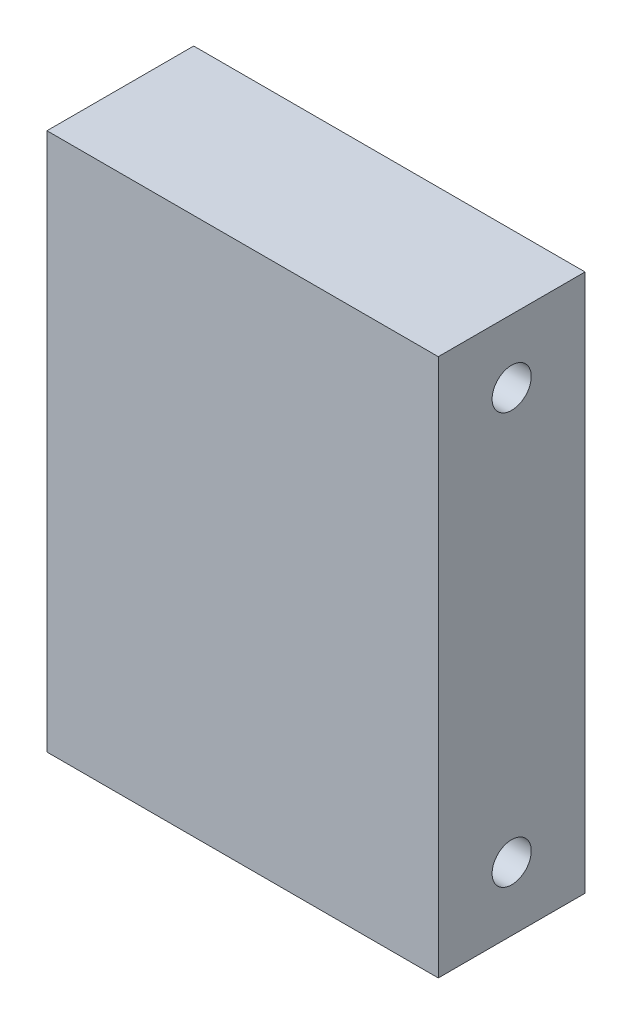
ISO-10303-21;
HEADER;
FILE_DESCRIPTION(('STEP AP214'),'2;1');
FILE_NAME('part.step','',(''),(''),'','','');
FILE_SCHEMA(('AUTOMOTIVE_DESIGN { 1 0 10303 214 1 1 1 1 }'));
ENDSEC;
DATA;
#1=APPLICATION_CONTEXT('core data for automotive mechanical design processes');
#2=APPLICATION_PROTOCOL_DEFINITION('international standard','automotive_design',2000,#1);
#3=PRODUCT_CONTEXT('',#1,'mechanical');
#4=PRODUCT('Part','Part','',(#3));
#5=PRODUCT_RELATED_PRODUCT_CATEGORY('part','',(#4));
#6=PRODUCT_DEFINITION_FORMATION('','',#4);
#7=PRODUCT_DEFINITION_CONTEXT('part definition',#1,'design');
#8=PRODUCT_DEFINITION('design','',#6,#7);
#9=PRODUCT_DEFINITION_SHAPE('','',#8);
#10=(LENGTH_UNIT() NAMED_UNIT(*) SI_UNIT(.MILLI.,.METRE.));
#11=(NAMED_UNIT(*) PLANE_ANGLE_UNIT() SI_UNIT($,.RADIAN.));
#12=(NAMED_UNIT(*) SI_UNIT($,.STERADIAN.) SOLID_ANGLE_UNIT());
#13=UNCERTAINTY_MEASURE_WITH_UNIT(LENGTH_MEASURE(1.E-05),#10,'distance_accuracy_value','');
#14=(GEOMETRIC_REPRESENTATION_CONTEXT(3) GLOBAL_UNCERTAINTY_ASSIGNED_CONTEXT((#13)) GLOBAL_UNIT_ASSIGNED_CONTEXT((#10,
#11,#12)) REPRESENTATION_CONTEXT('',''));
#15=CARTESIAN_POINT('',(0.,0.,0.));
#16=DIRECTION('',(0.,0.,1.));
#17=DIRECTION('',(1.,0.,0.));
#18=AXIS2_PLACEMENT_3D('',#15,#16,#17);
#19=CARTESIAN_POINT('',(-20.,27.5,15.));
#20=DIRECTION('',(1.,0.,0.));
#21=DIRECTION('',(0.,1.,0.));
#22=AXIS2_PLACEMENT_3D('',#19,#20,#21);
#23=PLANE('',#22);
#24=CARTESIAN_POINT('',(-20.,-21.,7.5));
#25=DIRECTION('',(-1.,0.,0.));
#26=DIRECTION('',(0.,-1.,0.));
#27=AXIS2_PLACEMENT_3D('',#24,#25,#26);
#28=CIRCLE('',#27,2.);
#29=CARTESIAN_POINT('',(-20.,-23.,7.5));
#30=VERTEX_POINT('',#29);
#31=EDGE_CURVE('E128',#30,#30,#28,.T.);
#32=ORIENTED_EDGE('',*,*,#31,.F.);
#33=EDGE_LOOP('',(#32));
#34=FACE_BOUND('',#33,.T.);
#35=CARTESIAN_POINT('',(-20.,21.,7.5));
#36=DIRECTION('',(-1.,0.,0.));
#37=DIRECTION('',(0.,-1.,0.));
#38=AXIS2_PLACEMENT_3D('',#35,#36,#37);
#39=CIRCLE('',#38,2.);
#40=CARTESIAN_POINT('',(-20.,19.,7.5));
#41=VERTEX_POINT('',#40);
#42=EDGE_CURVE('E122',#41,#41,#39,.T.);
#43=ORIENTED_EDGE('',*,*,#42,.F.);
#44=EDGE_LOOP('',(#43));
#45=FACE_BOUND('',#44,.T.);
#46=DIRECTION('',(0.,-1.,0.));
#47=VECTOR('',#46,1.);
#48=CARTESIAN_POINT('',(-20.,27.5,0.));
#49=LINE('',#48,#47);
#50=CARTESIAN_POINT('',(-20.,27.5,0.));
#51=VERTEX_POINT('',#50);
#52=CARTESIAN_POINT('',(-20.,-27.5,0.));
#53=VERTEX_POINT('',#52);
#54=EDGE_CURVE('E96',#51,#53,#49,.T.);
#55=ORIENTED_EDGE('',*,*,#54,.T.);
#56=DIRECTION('',(0.,0.,-1.));
#57=VECTOR('',#56,1.);
#58=CARTESIAN_POINT('',(-20.,-27.5,15.));
#59=LINE('',#58,#57);
#60=CARTESIAN_POINT('',(-20.,-27.5,15.));
#61=VERTEX_POINT('',#60);
#62=EDGE_CURVE('E11',#61,#53,#59,.T.);
#63=ORIENTED_EDGE('',*,*,#62,.F.);
#64=DIRECTION('',(0.,-1.,0.));
#65=VECTOR('',#64,1.);
#66=CARTESIAN_POINT('',(-20.,27.5,15.));
#67=LINE('',#66,#65);
#68=CARTESIAN_POINT('',(-20.,27.5,15.));
#69=VERTEX_POINT('',#68);
#70=EDGE_CURVE('E84',#69,#61,#67,.T.);
#71=ORIENTED_EDGE('',*,*,#70,.F.);
#72=DIRECTION('',(0.,0.,-1.));
#73=VECTOR('',#72,1.);
#74=CARTESIAN_POINT('',(-20.,27.5,15.));
#75=LINE('',#74,#73);
#76=EDGE_CURVE('E92',#69,#51,#75,.T.);
#77=ORIENTED_EDGE('',*,*,#76,.T.);
#78=EDGE_LOOP('',(#55,#63,#71,#77));
#79=FACE_BOUND('',#78,.T.);
#80=ADVANCED_FACE('F33',(#34,#45,#79),#23,.F.);
#81=CARTESIAN_POINT('',(-20.,-27.5,15.));
#82=DIRECTION('',(0.,1.,0.));
#83=DIRECTION('',(0.,0.,1.));
#84=AXIS2_PLACEMENT_3D('',#81,#82,#83);
#85=PLANE('',#84);
#86=DIRECTION('',(1.,0.,0.));
#87=VECTOR('',#86,1.);
#88=CARTESIAN_POINT('',(-20.,-27.5,0.));
#89=LINE('',#88,#87);
#90=CARTESIAN_POINT('',(20.,-27.5,0.));
#91=VERTEX_POINT('',#90);
#92=EDGE_CURVE('E88',#53,#91,#89,.T.);
#93=ORIENTED_EDGE('',*,*,#92,.T.);
#94=DIRECTION('',(0.,0.,-1.));
#95=VECTOR('',#94,1.);
#96=CARTESIAN_POINT('',(20.,-27.5,15.));
#97=LINE('',#96,#95);
#98=CARTESIAN_POINT('',(20.,-27.5,15.));
#99=VERTEX_POINT('',#98);
#100=EDGE_CURVE('E41',#99,#91,#97,.T.);
#101=ORIENTED_EDGE('',*,*,#100,.F.);
#102=DIRECTION('',(1.,0.,0.));
#103=VECTOR('',#102,1.);
#104=CARTESIAN_POINT('',(-20.,-27.5,15.));
#105=LINE('',#104,#103);
#106=EDGE_CURVE('E79',#61,#99,#105,.T.);
#107=ORIENTED_EDGE('',*,*,#106,.F.);
#108=ORIENTED_EDGE('',*,*,#62,.T.);
#109=EDGE_LOOP('',(#93,#101,#107,#108));
#110=FACE_BOUND('',#109,.T.);
#111=ADVANCED_FACE('F87',(#110),#85,.F.);
#112=CARTESIAN_POINT('',(20.,27.5,15.));
#113=DIRECTION('',(-1.,0.,0.));
#114=DIRECTION('',(0.,-1.,0.));
#115=AXIS2_PLACEMENT_3D('',#112,#113,#114);
#116=PLANE('',#115);
#117=CARTESIAN_POINT('',(20.,-21.,7.5));
#118=DIRECTION('',(1.,0.,0.));
#119=DIRECTION('',(0.,1.,0.));
#120=AXIS2_PLACEMENT_3D('',#117,#118,#119);
#121=CIRCLE('',#120,2.);
#122=CARTESIAN_POINT('',(20.,-19.,7.5));
#123=VERTEX_POINT('',#122);
#124=EDGE_CURVE('E116',#123,#123,#121,.T.);
#125=ORIENTED_EDGE('',*,*,#124,.F.);
#126=EDGE_LOOP('',(#125));
#127=FACE_BOUND('',#126,.T.);
#128=CARTESIAN_POINT('',(20.,21.,7.5));
#129=DIRECTION('',(1.,0.,0.));
#130=DIRECTION('',(0.,1.,0.));
#131=AXIS2_PLACEMENT_3D('',#128,#129,#130);
#132=CIRCLE('',#131,2.);
#133=CARTESIAN_POINT('',(20.,23.,7.5));
#134=VERTEX_POINT('',#133);
#135=EDGE_CURVE('E110',#134,#134,#132,.T.);
#136=ORIENTED_EDGE('',*,*,#135,.F.);
#137=EDGE_LOOP('',(#136));
#138=FACE_BOUND('',#137,.T.);
#139=DIRECTION('',(0.,1.,0.));
#140=VECTOR('',#139,1.);
#141=CARTESIAN_POINT('',(20.,27.5,0.));
#142=LINE('',#141,#140);
#143=CARTESIAN_POINT('',(20.,27.5,0.));
#144=VERTEX_POINT('',#143);
#145=EDGE_CURVE('E66',#91,#144,#142,.T.);
#146=ORIENTED_EDGE('',*,*,#145,.T.);
#147=DIRECTION('',(0.,0.,-1.));
#148=VECTOR('',#147,1.);
#149=CARTESIAN_POINT('',(20.,27.5,15.));
#150=LINE('',#149,#148);
#151=CARTESIAN_POINT('',(20.,27.5,15.));
#152=VERTEX_POINT('',#151);
#153=EDGE_CURVE('E89',#152,#144,#150,.T.);
#154=ORIENTED_EDGE('',*,*,#153,.F.);
#155=DIRECTION('',(0.,1.,0.));
#156=VECTOR('',#155,1.);
#157=CARTESIAN_POINT('',(20.,27.5,15.));
#158=LINE('',#157,#156);
#159=EDGE_CURVE('E82',#99,#152,#158,.T.);
#160=ORIENTED_EDGE('',*,*,#159,.F.);
#161=ORIENTED_EDGE('',*,*,#100,.T.);
#162=EDGE_LOOP('',(#146,#154,#160,#161));
#163=FACE_BOUND('',#162,.T.);
#164=ADVANCED_FACE('F90',(#127,#138,#163),#116,.F.);
#165=CARTESIAN_POINT('',(-20.,27.5,15.));
#166=DIRECTION('',(0.,-1.,0.));
#167=DIRECTION('',(1.,0.,0.));
#168=AXIS2_PLACEMENT_3D('',#165,#166,#167);
#169=PLANE('',#168);
#170=DIRECTION('',(-1.,0.,0.));
#171=VECTOR('',#170,1.);
#172=CARTESIAN_POINT('',(-20.,27.5,0.));
#173=LINE('',#172,#171);
#174=EDGE_CURVE('E72',#144,#51,#173,.T.);
#175=ORIENTED_EDGE('',*,*,#174,.T.);
#176=ORIENTED_EDGE('',*,*,#76,.F.);
#177=DIRECTION('',(-1.,0.,0.));
#178=VECTOR('',#177,1.);
#179=CARTESIAN_POINT('',(-20.,27.5,15.));
#180=LINE('',#179,#178);
#181=EDGE_CURVE('E49',#152,#69,#180,.T.);
#182=ORIENTED_EDGE('',*,*,#181,.F.);
#183=ORIENTED_EDGE('',*,*,#153,.T.);
#184=EDGE_LOOP('',(#175,#176,#182,#183));
#185=FACE_BOUND('',#184,.T.);
#186=ADVANCED_FACE('F104',(#185),#169,.F.);
#187=CARTESIAN_POINT('',(0.,0.,15.));
#188=DIRECTION('',(0.,0.,1.));
#189=DIRECTION('',(1.,0.,0.));
#190=AXIS2_PLACEMENT_3D('',#187,#188,#189);
#191=PLANE('',#190);
#192=ORIENTED_EDGE('',*,*,#70,.T.);
#193=ORIENTED_EDGE('',*,*,#106,.T.);
#194=ORIENTED_EDGE('',*,*,#159,.T.);
#195=ORIENTED_EDGE('',*,*,#181,.T.);
#196=EDGE_LOOP('',(#192,#193,#194,#195));
#197=FACE_BOUND('',#196,.T.);
#198=ADVANCED_FACE('F80',(#197),#191,.T.);
#199=CARTESIAN_POINT('',(0.,0.,0.));
#200=DIRECTION('',(0.,0.,1.));
#201=DIRECTION('',(1.,0.,0.));
#202=AXIS2_PLACEMENT_3D('',#199,#200,#201);
#203=PLANE('',#202);
#204=ORIENTED_EDGE('',*,*,#54,.F.);
#205=ORIENTED_EDGE('',*,*,#174,.F.);
#206=ORIENTED_EDGE('',*,*,#145,.F.);
#207=ORIENTED_EDGE('',*,*,#92,.F.);
#208=EDGE_LOOP('',(#204,#205,#206,#207));
#209=FACE_BOUND('',#208,.T.);
#210=ADVANCED_FACE('F107',(#209),#203,.F.);
#211=CARTESIAN_POINT('',(15.,21.,7.5));
#212=DIRECTION('',(1.,0.,0.));
#213=DIRECTION('',(0.,1.,0.));
#214=AXIS2_PLACEMENT_3D('',#211,#212,#213);
#215=CYLINDRICAL_SURFACE('',#214,2.);
#216=CARTESIAN_POINT('',(15.,21.,7.5));
#217=DIRECTION('',(1.,0.,0.));
#218=DIRECTION('',(0.,1.,0.));
#219=AXIS2_PLACEMENT_3D('',#216,#217,#218);
#220=CIRCLE('',#219,2.);
#221=CARTESIAN_POINT('',(15.,23.,7.5));
#222=VERTEX_POINT('',#221);
#223=EDGE_CURVE('E99',#222,#222,#220,.T.);
#224=ORIENTED_EDGE('',*,*,#223,.F.);
#225=EDGE_LOOP('',(#224));
#226=FACE_BOUND('',#225,.T.);
#227=ORIENTED_EDGE('',*,*,#135,.T.);
#228=EDGE_LOOP('',(#227));
#229=FACE_BOUND('',#228,.T.);
#230=ADVANCED_FACE('F169',(#226,#229),#215,.F.);
#231=CARTESIAN_POINT('',(15.,21.,7.5));
#232=DIRECTION('',(1.,0.,0.));
#233=DIRECTION('',(0.,1.,0.));
#234=AXIS2_PLACEMENT_3D('',#231,#232,#233);
#235=PLANE('',#234);
#236=ORIENTED_EDGE('',*,*,#223,.T.);
#237=EDGE_LOOP('',(#236));
#238=FACE_BOUND('',#237,.T.);
#239=ADVANCED_FACE('F165',(#238),#235,.T.);
#240=CARTESIAN_POINT('',(15.,-21.,7.5));
#241=DIRECTION('',(1.,0.,0.));
#242=DIRECTION('',(0.,1.,0.));
#243=AXIS2_PLACEMENT_3D('',#240,#241,#242);
#244=CYLINDRICAL_SURFACE('',#243,2.);
#245=CARTESIAN_POINT('',(15.,-21.,7.5));
#246=DIRECTION('',(1.,0.,0.));
#247=DIRECTION('',(0.,1.,0.));
#248=AXIS2_PLACEMENT_3D('',#245,#246,#247);
#249=CIRCLE('',#248,2.);
#250=CARTESIAN_POINT('',(15.,-19.,7.5));
#251=VERTEX_POINT('',#250);
#252=EDGE_CURVE('E113',#251,#251,#249,.T.);
#253=ORIENTED_EDGE('',*,*,#252,.F.);
#254=EDGE_LOOP('',(#253));
#255=FACE_BOUND('',#254,.T.);
#256=ORIENTED_EDGE('',*,*,#124,.T.);
#257=EDGE_LOOP('',(#256));
#258=FACE_BOUND('',#257,.T.);
#259=ADVANCED_FACE('F158',(#255,#258),#244,.F.);
#260=CARTESIAN_POINT('',(15.,-21.,7.5));
#261=DIRECTION('',(1.,0.,0.));
#262=DIRECTION('',(0.,1.,0.));
#263=AXIS2_PLACEMENT_3D('',#260,#261,#262);
#264=PLANE('',#263);
#265=ORIENTED_EDGE('',*,*,#252,.T.);
#266=EDGE_LOOP('',(#265));
#267=FACE_BOUND('',#266,.T.);
#268=ADVANCED_FACE('F149',(#267),#264,.T.);
#269=CARTESIAN_POINT('',(-15.,21.,7.5));
#270=DIRECTION('',(-1.,0.,0.));
#271=DIRECTION('',(0.,-1.,0.));
#272=AXIS2_PLACEMENT_3D('',#269,#270,#271);
#273=CYLINDRICAL_SURFACE('',#272,2.);
#274=CARTESIAN_POINT('',(-15.,21.,7.5));
#275=DIRECTION('',(-1.,0.,0.));
#276=DIRECTION('',(0.,-1.,0.));
#277=AXIS2_PLACEMENT_3D('',#274,#275,#276);
#278=CIRCLE('',#277,2.);
#279=CARTESIAN_POINT('',(-15.,19.,7.5));
#280=VERTEX_POINT('',#279);
#281=EDGE_CURVE('E119',#280,#280,#278,.T.);
#282=ORIENTED_EDGE('',*,*,#281,.F.);
#283=EDGE_LOOP('',(#282));
#284=FACE_BOUND('',#283,.T.);
#285=ORIENTED_EDGE('',*,*,#42,.T.);
#286=EDGE_LOOP('',(#285));
#287=FACE_BOUND('',#286,.T.);
#288=ADVANCED_FACE('F147',(#284,#287),#273,.F.);
#289=CARTESIAN_POINT('',(-15.,21.,7.5));
#290=DIRECTION('',(-1.,0.,0.));
#291=DIRECTION('',(0.,-1.,0.));
#292=AXIS2_PLACEMENT_3D('',#289,#290,#291);
#293=PLANE('',#292);
#294=ORIENTED_EDGE('',*,*,#281,.T.);
#295=EDGE_LOOP('',(#294));
#296=FACE_BOUND('',#295,.T.);
#297=ADVANCED_FACE('F139',(#296),#293,.T.);
#298=CARTESIAN_POINT('',(-15.,-21.,7.5));
#299=DIRECTION('',(-1.,0.,0.));
#300=DIRECTION('',(0.,-1.,0.));
#301=AXIS2_PLACEMENT_3D('',#298,#299,#300);
#302=CYLINDRICAL_SURFACE('',#301,2.);
#303=CARTESIAN_POINT('',(-15.,-21.,7.5));
#304=DIRECTION('',(-1.,0.,0.));
#305=DIRECTION('',(0.,-1.,0.));
#306=AXIS2_PLACEMENT_3D('',#303,#304,#305);
#307=CIRCLE('',#306,2.);
#308=CARTESIAN_POINT('',(-15.,-23.,7.5));
#309=VERTEX_POINT('',#308);
#310=EDGE_CURVE('E125',#309,#309,#307,.T.);
#311=ORIENTED_EDGE('',*,*,#310,.F.);
#312=EDGE_LOOP('',(#311));
#313=FACE_BOUND('',#312,.T.);
#314=ORIENTED_EDGE('',*,*,#31,.T.);
#315=EDGE_LOOP('',(#314));
#316=FACE_BOUND('',#315,.T.);
#317=ADVANCED_FACE('F136',(#313,#316),#302,.F.);
#318=CARTESIAN_POINT('',(-15.,-21.,7.5));
#319=DIRECTION('',(-1.,0.,0.));
#320=DIRECTION('',(0.,-1.,0.));
#321=AXIS2_PLACEMENT_3D('',#318,#319,#320);
#322=PLANE('',#321);
#323=ORIENTED_EDGE('',*,*,#310,.T.);
#324=EDGE_LOOP('',(#323));
#325=FACE_BOUND('',#324,.T.);
#326=ADVANCED_FACE('F134',(#325),#322,.T.);
#327=CLOSED_SHELL('',(#80,#111,#164,#186,#198,#210,#230,#239,#259,#268,#288,#297,#317,#326));
#328=MANIFOLD_SOLID_BREP('B2',#327);
#329=ADVANCED_BREP_SHAPE_REPRESENTATION('',(#18,#328),#14);
#330=SHAPE_DEFINITION_REPRESENTATION(#9,#329);
ENDSEC;
END-ISO-10303-21;
